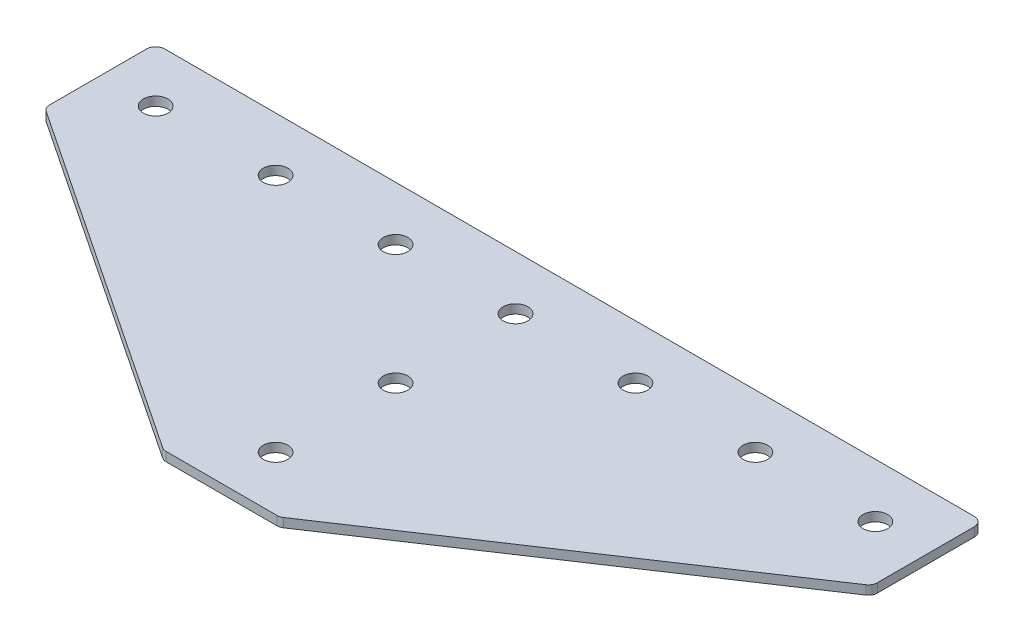
ISO-10303-21;
HEADER;
FILE_DESCRIPTION(('STEP AP214'),'2;1');
FILE_NAME('part.step','',(''),(''),'','','');
FILE_SCHEMA(('AUTOMOTIVE_DESIGN { 1 0 10303 214 1 1 1 1 }'));
ENDSEC;
DATA;
#1=APPLICATION_CONTEXT('core data for automotive mechanical design processes');
#2=APPLICATION_PROTOCOL_DEFINITION('international standard','automotive_design',2000,#1);
#3=PRODUCT_CONTEXT('',#1,'mechanical');
#4=PRODUCT('Part','Part','',(#3));
#5=PRODUCT_RELATED_PRODUCT_CATEGORY('part','',(#4));
#6=PRODUCT_DEFINITION_FORMATION('','',#4);
#7=PRODUCT_DEFINITION_CONTEXT('part definition',#1,'design');
#8=PRODUCT_DEFINITION('design','',#6,#7);
#9=PRODUCT_DEFINITION_SHAPE('','',#8);
#10=(LENGTH_UNIT() NAMED_UNIT(*) SI_UNIT(.MILLI.,.METRE.));
#11=(NAMED_UNIT(*) PLANE_ANGLE_UNIT() SI_UNIT($,.RADIAN.));
#12=(NAMED_UNIT(*) SI_UNIT($,.STERADIAN.) SOLID_ANGLE_UNIT());
#13=UNCERTAINTY_MEASURE_WITH_UNIT(LENGTH_MEASURE(1.E-05),#10,'distance_accuracy_value','');
#14=(GEOMETRIC_REPRESENTATION_CONTEXT(3) GLOBAL_UNCERTAINTY_ASSIGNED_CONTEXT((#13)) GLOBAL_UNIT_ASSIGNED_CONTEXT((#10,
#11,#12)) REPRESENTATION_CONTEXT('',''));
#15=CARTESIAN_POINT('',(0.,0.,0.));
#16=DIRECTION('',(0.,0.,1.));
#17=DIRECTION('',(1.,0.,0.));
#18=AXIS2_PLACEMENT_3D('',#15,#16,#17);
#19=CARTESIAN_POINT('',(-2.391536220955,1.20798729377475,-40.3160109846476));
#20=DIRECTION('',(0.,-1.,0.));
#21=DIRECTION('',(0.,0.,-1.));
#22=AXIS2_PLACEMENT_3D('',#19,#20,#21);
#23=PLANE('',#22);
#24=CARTESIAN_POINT('',(-2.391536220955,1.20798729377475,-40.3160109846476));
#25=DIRECTION('',(0.,1.,0.));
#26=DIRECTION('',(0.,0.,1.));
#27=AXIS2_PLACEMENT_3D('',#24,#25,#26);
#28=CIRCLE('',#27,4.1);
#29=CARTESIAN_POINT('',(-2.391536220955,1.20798729377475,-36.2160109846476));
#30=VERTEX_POINT('',#29);
#31=EDGE_CURVE('E119',#30,#30,#28,.T.);
#32=ORIENTED_EDGE('',*,*,#31,.T.);
#33=EDGE_LOOP('',(#32));
#34=FACE_BOUND('',#33,.T.);
#35=DIRECTION('',(1.,0.,0.));
#36=VECTOR('',#35,1.);
#37=CARTESIAN_POINT('',(-20.391536220955,1.20798729377475,57.6839890153524));
#38=LINE('',#37,#36);
#39=CARTESIAN_POINT('',(-20.877658032295,1.20798729377475,57.6839890153524));
#40=VERTEX_POINT('',#39);
#41=CARTESIAN_POINT('',(16.094585590385,1.20798729377475,57.6839890153524));
#42=VERTEX_POINT('',#41);
#43=EDGE_CURVE('E176',#40,#42,#38,.T.);
#44=ORIENTED_EDGE('',*,*,#43,.F.);
#45=CARTESIAN_POINT('',(-20.877658032295,1.20798729377475,54.6839890153524));
#46=DIRECTION('',(0.,1.,0.));
#47=DIRECTION('',(0.,0.,-1.));
#48=AXIS2_PLACEMENT_3D('',#45,#46,#47);
#49=CIRCLE('',#48,3.);
#50=CARTESIAN_POINT('',(-22.5417586209707,1.20798729377475,57.1801398983659));
#51=VERTEX_POINT('',#50);
#52=EDGE_CURVE('E233',#51,#40,#49,.T.);
#53=ORIENTED_EDGE('',*,*,#52,.F.);
#54=DIRECTION('',(-0.832050294337844,0.,-0.554700196225229));
#55=VECTOR('',#54,1.);
#56=CARTESIAN_POINT('',(-21.7859849454909,1.20798729377475,57.6839890153524));
#57=LINE('',#56,#55);
#58=CARTESIAN_POINT('',(-139.055636809631,1.20798729377475,-20.495778894074));
#59=VERTEX_POINT('',#58);
#60=EDGE_CURVE('E236',#51,#59,#57,.T.);
#61=ORIENTED_EDGE('',*,*,#60,.T.);
#62=CARTESIAN_POINT('',(-137.391536220955,1.20798729377475,-22.9919297770876));
#63=DIRECTION('',(0.,1.,0.));
#64=DIRECTION('',(0.,0.,-1.));
#65=AXIS2_PLACEMENT_3D('',#62,#63,#64);
#66=CIRCLE('',#65,3.);
#67=CARTESIAN_POINT('',(-140.391536220955,1.20798729377475,-22.9919297770875));
#68=VERTEX_POINT('',#67);
#69=EDGE_CURVE('E239',#68,#59,#66,.T.);
#70=ORIENTED_EDGE('',*,*,#69,.F.);
#71=DIRECTION('',(0.,0.,-1.));
#72=VECTOR('',#71,1.);
#73=CARTESIAN_POINT('',(-140.391536220955,1.20798729377475,-21.3863785016236));
#74=LINE('',#73,#72);
#75=CARTESIAN_POINT('',(-140.391536220955,1.20798729377475,-55.3160109846476));
#76=VERTEX_POINT('',#75);
#77=EDGE_CURVE('E130',#68,#76,#74,.T.);
#78=ORIENTED_EDGE('',*,*,#77,.T.);
#79=CARTESIAN_POINT('',(-137.391536220955,1.20798729377475,-55.3160109846476));
#80=DIRECTION('',(0.,1.,0.));
#81=DIRECTION('',(0.,0.,-1.));
#82=AXIS2_PLACEMENT_3D('',#79,#80,#81);
#83=CIRCLE('',#82,3.);
#84=CARTESIAN_POINT('',(-137.391536220955,1.20798729377475,-58.3160109846476));
#85=VERTEX_POINT('',#84);
#86=EDGE_CURVE('E245',#85,#76,#83,.T.);
#87=ORIENTED_EDGE('',*,*,#86,.F.);
#88=DIRECTION('',(-1.,0.,0.));
#89=VECTOR('',#88,1.);
#90=CARTESIAN_POINT('',(135.608463779045,1.20798729377475,-58.3160109846476));
#91=LINE('',#90,#89);
#92=CARTESIAN_POINT('',(132.608463779045,1.20798729377475,-58.3160109846476));
#93=VERTEX_POINT('',#92);
#94=EDGE_CURVE('E134',#93,#85,#91,.T.);
#95=ORIENTED_EDGE('',*,*,#94,.F.);
#96=CARTESIAN_POINT('',(132.608463779045,1.20798729377475,-55.3160109846476));
#97=DIRECTION('',(0.,-1.,0.));
#98=DIRECTION('',(0.,0.,-1.));
#99=AXIS2_PLACEMENT_3D('',#96,#97,#98);
#100=CIRCLE('',#99,3.);
#101=CARTESIAN_POINT('',(135.608463779045,1.20798729377475,-55.3160109846476));
#102=VERTEX_POINT('',#101);
#103=EDGE_CURVE('E197',#93,#102,#100,.T.);
#104=ORIENTED_EDGE('',*,*,#103,.T.);
#105=DIRECTION('',(0.,0.,-1.));
#106=VECTOR('',#105,1.);
#107=CARTESIAN_POINT('',(135.608463779045,1.20798729377475,-21.3863785016236));
#108=LINE('',#107,#106);
#109=CARTESIAN_POINT('',(135.608463779045,1.20798729377475,-22.9919297770876));
#110=VERTEX_POINT('',#109);
#111=EDGE_CURVE('E181',#110,#102,#108,.T.);
#112=ORIENTED_EDGE('',*,*,#111,.F.);
#113=CARTESIAN_POINT('',(132.608463779045,1.20798729377475,-22.9919297770876));
#114=DIRECTION('',(0.,-1.,0.));
#115=DIRECTION('',(0.,0.,-1.));
#116=AXIS2_PLACEMENT_3D('',#113,#114,#115);
#117=CIRCLE('',#116,3.);
#118=CARTESIAN_POINT('',(134.272564367721,1.20798729377475,-20.495778894074));
#119=VERTEX_POINT('',#118);
#120=EDGE_CURVE('E31',#110,#119,#117,.T.);
#121=ORIENTED_EDGE('',*,*,#120,.T.);
#122=DIRECTION('',(0.832050294337844,0.,-0.554700196225229));
#123=VECTOR('',#122,1.);
#124=CARTESIAN_POINT('',(17.002912503581,1.20798729377475,57.6839890153524));
#125=LINE('',#124,#123);
#126=CARTESIAN_POINT('',(17.7586861790607,1.20798729377475,57.1801398983659));
#127=VERTEX_POINT('',#126);
#128=EDGE_CURVE('E179',#127,#119,#125,.T.);
#129=ORIENTED_EDGE('',*,*,#128,.F.);
#130=CARTESIAN_POINT('',(16.094585590385,1.20798729377475,54.6839890153524));
#131=DIRECTION('',(0.,-1.,0.));
#132=DIRECTION('',(0.,0.,-1.));
#133=AXIS2_PLACEMENT_3D('',#130,#131,#132);
#134=CIRCLE('',#133,3.);
#135=EDGE_CURVE('E200',#127,#42,#134,.T.);
#136=ORIENTED_EDGE('',*,*,#135,.T.);
#137=EDGE_LOOP('',(#44,#53,#61,#70,#78,#87,#95,#104,#112,#121,#129,#136));
#138=FACE_BOUND('',#137,.T.);
#139=CARTESIAN_POINT('',(-2.39153622095501,1.20798729377475,39.6839890153524));
#140=DIRECTION('',(0.,1.,0.));
#141=DIRECTION('',(0.,0.,1.));
#142=AXIS2_PLACEMENT_3D('',#139,#140,#141);
#143=CIRCLE('',#142,4.1);
#144=CARTESIAN_POINT('',(-2.39153622095501,1.20798729377475,43.7839890153524));
#145=VERTEX_POINT('',#144);
#146=EDGE_CURVE('E153',#145,#145,#143,.T.);
#147=ORIENTED_EDGE('',*,*,#146,.T.);
#148=EDGE_LOOP('',(#147));
#149=FACE_BOUND('',#148,.T.);
#150=CARTESIAN_POINT('',(-2.39153622095501,1.20798729377475,-0.316010984647577));
#151=DIRECTION('',(0.,1.,0.));
#152=DIRECTION('',(0.,0.,1.));
#153=AXIS2_PLACEMENT_3D('',#150,#151,#152);
#154=CIRCLE('',#153,4.1);
#155=CARTESIAN_POINT('',(-2.39153622095501,1.20798729377475,3.78398901535242));
#156=VERTEX_POINT('',#155);
#157=EDGE_CURVE('E159',#156,#156,#154,.T.);
#158=ORIENTED_EDGE('',*,*,#157,.T.);
#159=EDGE_LOOP('',(#158));
#160=FACE_BOUND('',#159,.T.);
#161=CARTESIAN_POINT('',(117.608463779045,1.20798729377475,-40.3160109846476));
#162=DIRECTION('',(0.,1.,0.));
#163=DIRECTION('',(0.,0.,1.));
#164=AXIS2_PLACEMENT_3D('',#161,#162,#163);
#165=CIRCLE('',#164,4.09999999999999);
#166=CARTESIAN_POINT('',(117.608463779045,1.20798729377475,-36.2160109846476));
#167=VERTEX_POINT('',#166);
#168=EDGE_CURVE('E139',#167,#167,#165,.T.);
#169=ORIENTED_EDGE('',*,*,#168,.T.);
#170=EDGE_LOOP('',(#169));
#171=FACE_BOUND('',#170,.T.);
#172=CARTESIAN_POINT('',(77.608463779045,1.20798729377475,-40.3160109846476));
#173=DIRECTION('',(0.,1.,0.));
#174=DIRECTION('',(0.,0.,1.));
#175=AXIS2_PLACEMENT_3D('',#172,#173,#174);
#176=CIRCLE('',#175,4.1);
#177=CARTESIAN_POINT('',(77.608463779045,1.20798729377475,-36.2160109846476));
#178=VERTEX_POINT('',#177);
#179=EDGE_CURVE('E147',#178,#178,#176,.T.);
#180=ORIENTED_EDGE('',*,*,#179,.T.);
#181=EDGE_LOOP('',(#180));
#182=FACE_BOUND('',#181,.T.);
#183=CARTESIAN_POINT('',(37.608463779045,1.20798729377475,-40.3160109846476));
#184=DIRECTION('',(0.,1.,0.));
#185=DIRECTION('',(0.,0.,1.));
#186=AXIS2_PLACEMENT_3D('',#183,#184,#185);
#187=CIRCLE('',#186,4.1);
#188=CARTESIAN_POINT('',(37.608463779045,1.20798729377475,-36.2160109846476));
#189=VERTEX_POINT('',#188);
#190=EDGE_CURVE('E165',#189,#189,#187,.T.);
#191=ORIENTED_EDGE('',*,*,#190,.T.);
#192=EDGE_LOOP('',(#191));
#193=FACE_BOUND('',#192,.T.);
#194=CARTESIAN_POINT('',(-122.391536220955,1.20798729377475,-40.3160109846476));
#195=DIRECTION('',(0.,-1.,0.));
#196=DIRECTION('',(0.,0.,1.));
#197=AXIS2_PLACEMENT_3D('',#194,#195,#196);
#198=CIRCLE('',#197,4.09999999999999);
#199=CARTESIAN_POINT('',(-122.391536220955,1.20798729377475,-36.2160109846476));
#200=VERTEX_POINT('',#199);
#201=EDGE_CURVE('E465',#200,#200,#198,.T.);
#202=ORIENTED_EDGE('',*,*,#201,.F.);
#203=EDGE_LOOP('',(#202));
#204=FACE_BOUND('',#203,.T.);
#205=CARTESIAN_POINT('',(-82.391536220955,1.20798729377475,-40.3160109846476));
#206=DIRECTION('',(0.,-1.,0.));
#207=DIRECTION('',(0.,0.,1.));
#208=AXIS2_PLACEMENT_3D('',#205,#206,#207);
#209=CIRCLE('',#208,4.1);
#210=CARTESIAN_POINT('',(-82.391536220955,1.20798729377475,-36.2160109846476));
#211=VERTEX_POINT('',#210);
#212=EDGE_CURVE('E474',#211,#211,#209,.T.);
#213=ORIENTED_EDGE('',*,*,#212,.F.);
#214=EDGE_LOOP('',(#213));
#215=FACE_BOUND('',#214,.T.);
#216=CARTESIAN_POINT('',(-42.391536220955,1.20798729377475,-40.3160109846476));
#217=DIRECTION('',(0.,-1.,0.));
#218=DIRECTION('',(0.,0.,1.));
#219=AXIS2_PLACEMENT_3D('',#216,#217,#218);
#220=CIRCLE('',#219,4.1);
#221=CARTESIAN_POINT('',(-42.391536220955,1.20798729377475,-36.2160109846476));
#222=VERTEX_POINT('',#221);
#223=EDGE_CURVE('E266',#222,#222,#220,.T.);
#224=ORIENTED_EDGE('',*,*,#223,.F.);
#225=EDGE_LOOP('',(#224));
#226=FACE_BOUND('',#225,.T.);
#227=ADVANCED_FACE('F16',(#34,#138,#149,#160,#171,#182,#193,#204,#215,#226),#23,.T.);
#228=CARTESIAN_POINT('',(135.608463779045,1.20798729377475,-58.3160109846476));
#229=DIRECTION('',(0.,0.,-1.));
#230=DIRECTION('',(-1.,0.,0.));
#231=AXIS2_PLACEMENT_3D('',#228,#229,#230);
#232=PLANE('',#231);
#233=ORIENTED_EDGE('',*,*,#94,.T.);
#234=DIRECTION('',(0.,1.,0.));
#235=VECTOR('',#234,1.);
#236=CARTESIAN_POINT('',(-137.391536220955,1.20798729377475,-58.3160109846476));
#237=LINE('',#236,#235);
#238=CARTESIAN_POINT('',(-137.391536220955,4.20798729377475,-58.3160109846476));
#239=VERTEX_POINT('',#238);
#240=EDGE_CURVE('E125',#239,#85,#237,.F.);
#241=ORIENTED_EDGE('',*,*,#240,.F.);
#242=DIRECTION('',(-1.,0.,0.));
#243=VECTOR('',#242,1.);
#244=CARTESIAN_POINT('',(135.608463779045,4.20798729377475,-58.3160109846476));
#245=LINE('',#244,#243);
#246=CARTESIAN_POINT('',(132.608463779045,4.20798729377475,-58.3160109846476));
#247=VERTEX_POINT('',#246);
#248=EDGE_CURVE('E105',#247,#239,#245,.T.);
#249=ORIENTED_EDGE('',*,*,#248,.F.);
#250=DIRECTION('',(0.,1.,0.));
#251=VECTOR('',#250,1.);
#252=CARTESIAN_POINT('',(132.608463779045,1.20798729377475,-58.3160109846476));
#253=LINE('',#252,#251);
#254=EDGE_CURVE('E10',#247,#93,#253,.F.);
#255=ORIENTED_EDGE('',*,*,#254,.T.);
#256=EDGE_LOOP('',(#233,#241,#249,#255));
#257=FACE_BOUND('',#256,.T.);
#258=ADVANCED_FACE('F132',(#257),#232,.T.);
#259=CARTESIAN_POINT('',(135.608463779045,1.20798729377475,-21.3863785016236));
#260=DIRECTION('',(1.,0.,0.));
#261=DIRECTION('',(0.,0.,-1.));
#262=AXIS2_PLACEMENT_3D('',#259,#260,#261);
#263=PLANE('',#262);
#264=DIRECTION('',(0.,0.,-1.));
#265=VECTOR('',#264,1.);
#266=CARTESIAN_POINT('',(135.608463779045,4.20798729377475,-21.3863785016236));
#267=LINE('',#266,#265);
#268=CARTESIAN_POINT('',(135.608463779045,4.20798729377475,-22.9919297770876));
#269=VERTEX_POINT('',#268);
#270=CARTESIAN_POINT('',(135.608463779045,4.20798729377475,-55.3160109846476));
#271=VERTEX_POINT('',#270);
#272=EDGE_CURVE('E177',#269,#271,#267,.T.);
#273=ORIENTED_EDGE('',*,*,#272,.F.);
#274=DIRECTION('',(0.,1.,0.));
#275=VECTOR('',#274,1.);
#276=CARTESIAN_POINT('',(135.608463779045,1.20798729377475,-22.9919297770876));
#277=LINE('',#276,#275);
#278=EDGE_CURVE('E24',#269,#110,#277,.F.);
#279=ORIENTED_EDGE('',*,*,#278,.T.);
#280=ORIENTED_EDGE('',*,*,#111,.T.);
#281=DIRECTION('',(0.,1.,0.));
#282=VECTOR('',#281,1.);
#283=CARTESIAN_POINT('',(135.608463779045,1.20798729377475,-55.3160109846476));
#284=LINE('',#283,#282);
#285=EDGE_CURVE('E207',#102,#271,#284,.T.);
#286=ORIENTED_EDGE('',*,*,#285,.T.);
#287=EDGE_LOOP('',(#273,#279,#280,#286));
#288=FACE_BOUND('',#287,.T.);
#289=ADVANCED_FACE('F212',(#288),#263,.T.);
#290=CARTESIAN_POINT('',(17.002912503581,1.20798729377475,57.6839890153524));
#291=DIRECTION('',(0.554700196225229,0.,0.832050294337844));
#292=DIRECTION('',(0.832050294337844,0.,-0.554700196225229));
#293=AXIS2_PLACEMENT_3D('',#290,#291,#292);
#294=PLANE('',#293);
#295=DIRECTION('',(0.832050294337844,0.,-0.554700196225229));
#296=VECTOR('',#295,1.);
#297=CARTESIAN_POINT('',(17.002912503581,4.20798729377475,57.6839890153524));
#298=LINE('',#297,#296);
#299=CARTESIAN_POINT('',(17.7586861790607,4.20798729377475,57.1801398983659));
#300=VERTEX_POINT('',#299);
#301=CARTESIAN_POINT('',(134.272564367721,4.20798729377475,-20.495778894074));
#302=VERTEX_POINT('',#301);
#303=EDGE_CURVE('E185',#300,#302,#298,.T.);
#304=ORIENTED_EDGE('',*,*,#303,.F.);
#305=DIRECTION('',(0.,1.,0.));
#306=VECTOR('',#305,1.);
#307=CARTESIAN_POINT('',(17.7586861790607,1.20798729377475,57.1801398983659));
#308=LINE('',#307,#306);
#309=EDGE_CURVE('E38',#300,#127,#308,.F.);
#310=ORIENTED_EDGE('',*,*,#309,.T.);
#311=ORIENTED_EDGE('',*,*,#128,.T.);
#312=DIRECTION('',(0.,1.,0.));
#313=VECTOR('',#312,1.);
#314=CARTESIAN_POINT('',(134.272564367721,1.20798729377475,-20.4957788940741));
#315=LINE('',#314,#313);
#316=EDGE_CURVE('E203',#119,#302,#315,.T.);
#317=ORIENTED_EDGE('',*,*,#316,.T.);
#318=EDGE_LOOP('',(#304,#310,#311,#317));
#319=FACE_BOUND('',#318,.T.);
#320=ADVANCED_FACE('F219',(#319),#294,.T.);
#321=CARTESIAN_POINT('',(-20.391536220955,1.20798729377475,57.6839890153524));
#322=DIRECTION('',(0.,0.,1.));
#323=DIRECTION('',(1.,0.,0.));
#324=AXIS2_PLACEMENT_3D('',#321,#322,#323);
#325=PLANE('',#324);
#326=DIRECTION('',(1.,0.,0.));
#327=VECTOR('',#326,1.);
#328=CARTESIAN_POINT('',(-20.391536220955,4.20798729377475,57.6839890153524));
#329=LINE('',#328,#327);
#330=CARTESIAN_POINT('',(-20.877658032295,4.20798729377475,57.6839890153524));
#331=VERTEX_POINT('',#330);
#332=CARTESIAN_POINT('',(16.094585590385,4.20798729377475,57.6839890153524));
#333=VERTEX_POINT('',#332);
#334=EDGE_CURVE('E118',#331,#333,#329,.T.);
#335=ORIENTED_EDGE('',*,*,#334,.F.);
#336=DIRECTION('',(0.,1.,0.));
#337=VECTOR('',#336,1.);
#338=CARTESIAN_POINT('',(-20.877658032295,1.20798729377475,57.6839890153524));
#339=LINE('',#338,#337);
#340=EDGE_CURVE('E229',#40,#331,#339,.T.);
#341=ORIENTED_EDGE('',*,*,#340,.F.);
#342=ORIENTED_EDGE('',*,*,#43,.T.);
#343=DIRECTION('',(0.,1.,0.));
#344=VECTOR('',#343,1.);
#345=CARTESIAN_POINT('',(16.094585590385,1.20798729377475,57.6839890153524));
#346=LINE('',#345,#344);
#347=EDGE_CURVE('E194',#42,#333,#346,.T.);
#348=ORIENTED_EDGE('',*,*,#347,.T.);
#349=EDGE_LOOP('',(#335,#341,#342,#348));
#350=FACE_BOUND('',#349,.T.);
#351=ADVANCED_FACE('F226',(#350),#325,.T.);
#352=CARTESIAN_POINT('',(-2.391536220955,4.20798729377475,-40.3160109846476));
#353=DIRECTION('',(0.,-1.,0.));
#354=DIRECTION('',(0.,0.,-1.));
#355=AXIS2_PLACEMENT_3D('',#352,#353,#354);
#356=PLANE('',#355);
#357=CARTESIAN_POINT('',(-2.391536220955,4.20798729377475,-40.3160109846476));
#358=DIRECTION('',(0.,1.,0.));
#359=DIRECTION('',(0.,0.,1.));
#360=AXIS2_PLACEMENT_3D('',#357,#358,#359);
#361=CIRCLE('',#360,4.1);
#362=CARTESIAN_POINT('',(-2.391536220955,4.20798729377475,-36.2160109846476));
#363=VERTEX_POINT('',#362);
#364=EDGE_CURVE('E168',#363,#363,#361,.T.);
#365=ORIENTED_EDGE('',*,*,#364,.F.);
#366=EDGE_LOOP('',(#365));
#367=FACE_BOUND('',#366,.T.);
#368=CARTESIAN_POINT('',(-20.877658032295,4.20798729377475,54.6839890153524));
#369=DIRECTION('',(0.,1.,0.));
#370=DIRECTION('',(0.,0.,-1.));
#371=AXIS2_PLACEMENT_3D('',#368,#369,#370);
#372=CIRCLE('',#371,3.);
#373=CARTESIAN_POINT('',(-22.5417586209707,4.20798729377475,57.1801398983659));
#374=VERTEX_POINT('',#373);
#375=EDGE_CURVE('E251',#331,#374,#372,.F.);
#376=ORIENTED_EDGE('',*,*,#375,.F.);
#377=ORIENTED_EDGE('',*,*,#334,.T.);
#378=CARTESIAN_POINT('',(16.094585590385,4.20798729377475,54.6839890153524));
#379=DIRECTION('',(0.,-1.,0.));
#380=DIRECTION('',(0.,0.,-1.));
#381=AXIS2_PLACEMENT_3D('',#378,#379,#380);
#382=CIRCLE('',#381,3.);
#383=EDGE_CURVE('E192',#333,#300,#382,.F.);
#384=ORIENTED_EDGE('',*,*,#383,.T.);
#385=ORIENTED_EDGE('',*,*,#303,.T.);
#386=CARTESIAN_POINT('',(132.608463779045,4.20798729377475,-22.9919297770876));
#387=DIRECTION('',(0.,-1.,0.));
#388=DIRECTION('',(0.,0.,-1.));
#389=AXIS2_PLACEMENT_3D('',#386,#387,#388);
#390=CIRCLE('',#389,3.);
#391=EDGE_CURVE('E190',#302,#269,#390,.F.);
#392=ORIENTED_EDGE('',*,*,#391,.T.);
#393=ORIENTED_EDGE('',*,*,#272,.T.);
#394=CARTESIAN_POINT('',(132.608463779045,4.20798729377475,-55.3160109846476));
#395=DIRECTION('',(0.,-1.,0.));
#396=DIRECTION('',(0.,0.,-1.));
#397=AXIS2_PLACEMENT_3D('',#394,#395,#396);
#398=CIRCLE('',#397,3.);
#399=EDGE_CURVE('E114',#271,#247,#398,.F.);
#400=ORIENTED_EDGE('',*,*,#399,.T.);
#401=ORIENTED_EDGE('',*,*,#248,.T.);
#402=CARTESIAN_POINT('',(-137.391536220955,4.20798729377475,-55.3160109846476));
#403=DIRECTION('',(0.,1.,0.));
#404=DIRECTION('',(0.,0.,-1.));
#405=AXIS2_PLACEMENT_3D('',#402,#403,#404);
#406=CIRCLE('',#405,3.);
#407=CARTESIAN_POINT('',(-140.391536220955,4.20798729377475,-55.3160109846476));
#408=VERTEX_POINT('',#407);
#409=EDGE_CURVE('E111',#408,#239,#406,.F.);
#410=ORIENTED_EDGE('',*,*,#409,.F.);
#411=DIRECTION('',(0.,0.,-1.));
#412=VECTOR('',#411,1.);
#413=CARTESIAN_POINT('',(-140.391536220955,4.20798729377475,-21.3863785016236));
#414=LINE('',#413,#412);
#415=CARTESIAN_POINT('',(-140.391536220955,4.20798729377475,-22.9919297770875));
#416=VERTEX_POINT('',#415);
#417=EDGE_CURVE('E256',#416,#408,#414,.T.);
#418=ORIENTED_EDGE('',*,*,#417,.F.);
#419=CARTESIAN_POINT('',(-137.391536220955,4.20798729377475,-22.9919297770876));
#420=DIRECTION('',(0.,1.,0.));
#421=DIRECTION('',(0.,0.,-1.));
#422=AXIS2_PLACEMENT_3D('',#419,#420,#421);
#423=CIRCLE('',#422,3.);
#424=CARTESIAN_POINT('',(-139.055636809631,4.20798729377475,-20.495778894074));
#425=VERTEX_POINT('',#424);
#426=EDGE_CURVE('E129',#425,#416,#423,.F.);
#427=ORIENTED_EDGE('',*,*,#426,.F.);
#428=DIRECTION('',(-0.832050294337844,0.,-0.554700196225229));
#429=VECTOR('',#428,1.);
#430=CARTESIAN_POINT('',(-21.7859849454909,4.20798729377475,57.6839890153524));
#431=LINE('',#430,#429);
#432=EDGE_CURVE('E260',#374,#425,#431,.T.);
#433=ORIENTED_EDGE('',*,*,#432,.F.);
#434=EDGE_LOOP('',(#376,#377,#384,#385,#392,#393,#400,#401,#410,#418,#427,#433));
#435=FACE_BOUND('',#434,.T.);
#436=CARTESIAN_POINT('',(-2.39153622095501,4.20798729377475,39.6839890153524));
#437=DIRECTION('',(0.,1.,0.));
#438=DIRECTION('',(0.,0.,1.));
#439=AXIS2_PLACEMENT_3D('',#436,#437,#438);
#440=CIRCLE('',#439,4.1);
#441=CARTESIAN_POINT('',(-2.39153622095501,4.20798729377475,43.7839890153524));
#442=VERTEX_POINT('',#441);
#443=EDGE_CURVE('E150',#442,#442,#440,.T.);
#444=ORIENTED_EDGE('',*,*,#443,.F.);
#445=EDGE_LOOP('',(#444));
#446=FACE_BOUND('',#445,.T.);
#447=CARTESIAN_POINT('',(117.608463779045,4.20798729377475,-40.3160109846476));
#448=DIRECTION('',(0.,1.,0.));
#449=DIRECTION('',(0.,0.,1.));
#450=AXIS2_PLACEMENT_3D('',#447,#448,#449);
#451=CIRCLE('',#450,4.09999999999999);
#452=CARTESIAN_POINT('',(117.608463779045,4.20798729377475,-36.2160109846476));
#453=VERTEX_POINT('',#452);
#454=EDGE_CURVE('E135',#453,#453,#451,.T.);
#455=ORIENTED_EDGE('',*,*,#454,.F.);
#456=EDGE_LOOP('',(#455));
#457=FACE_BOUND('',#456,.T.);
#458=CARTESIAN_POINT('',(77.608463779045,4.20798729377475,-40.3160109846476));
#459=DIRECTION('',(0.,1.,0.));
#460=DIRECTION('',(0.,0.,1.));
#461=AXIS2_PLACEMENT_3D('',#458,#459,#460);
#462=CIRCLE('',#461,4.1);
#463=CARTESIAN_POINT('',(77.608463779045,4.20798729377475,-36.2160109846476));
#464=VERTEX_POINT('',#463);
#465=EDGE_CURVE('E145',#464,#464,#462,.T.);
#466=ORIENTED_EDGE('',*,*,#465,.F.);
#467=EDGE_LOOP('',(#466));
#468=FACE_BOUND('',#467,.T.);
#469=CARTESIAN_POINT('',(37.608463779045,4.20798729377475,-40.3160109846476));
#470=DIRECTION('',(0.,1.,0.));
#471=DIRECTION('',(0.,0.,1.));
#472=AXIS2_PLACEMENT_3D('',#469,#470,#471);
#473=CIRCLE('',#472,4.1);
#474=CARTESIAN_POINT('',(37.608463779045,4.20798729377475,-36.2160109846476));
#475=VERTEX_POINT('',#474);
#476=EDGE_CURVE('E162',#475,#475,#473,.T.);
#477=ORIENTED_EDGE('',*,*,#476,.F.);
#478=EDGE_LOOP('',(#477));
#479=FACE_BOUND('',#478,.T.);
#480=CARTESIAN_POINT('',(-2.39153622095501,4.20798729377475,-0.316010984647577));
#481=DIRECTION('',(0.,1.,0.));
#482=DIRECTION('',(0.,0.,1.));
#483=AXIS2_PLACEMENT_3D('',#480,#481,#482);
#484=CIRCLE('',#483,4.1);
#485=CARTESIAN_POINT('',(-2.39153622095501,4.20798729377475,3.78398901535242));
#486=VERTEX_POINT('',#485);
#487=EDGE_CURVE('E156',#486,#486,#484,.T.);
#488=ORIENTED_EDGE('',*,*,#487,.F.);
#489=EDGE_LOOP('',(#488));
#490=FACE_BOUND('',#489,.T.);
#491=CARTESIAN_POINT('',(-122.391536220955,4.20798729377475,-40.3160109846476));
#492=DIRECTION('',(0.,-1.,0.));
#493=DIRECTION('',(0.,0.,1.));
#494=AXIS2_PLACEMENT_3D('',#491,#492,#493);
#495=CIRCLE('',#494,4.09999999999999);
#496=CARTESIAN_POINT('',(-122.391536220955,4.20798729377475,-36.2160109846476));
#497=VERTEX_POINT('',#496);
#498=EDGE_CURVE('E468',#497,#497,#495,.T.);
#499=ORIENTED_EDGE('',*,*,#498,.T.);
#500=EDGE_LOOP('',(#499));
#501=FACE_BOUND('',#500,.T.);
#502=CARTESIAN_POINT('',(-82.391536220955,4.20798729377475,-40.3160109846476));
#503=DIRECTION('',(0.,-1.,0.));
#504=DIRECTION('',(0.,0.,1.));
#505=AXIS2_PLACEMENT_3D('',#502,#503,#504);
#506=CIRCLE('',#505,4.1);
#507=CARTESIAN_POINT('',(-82.391536220955,4.20798729377475,-36.2160109846476));
#508=VERTEX_POINT('',#507);
#509=EDGE_CURVE('E471',#508,#508,#506,.T.);
#510=ORIENTED_EDGE('',*,*,#509,.T.);
#511=EDGE_LOOP('',(#510));
#512=FACE_BOUND('',#511,.T.);
#513=CARTESIAN_POINT('',(-42.391536220955,4.20798729377475,-40.3160109846476));
#514=DIRECTION('',(0.,-1.,0.));
#515=DIRECTION('',(0.,0.,1.));
#516=AXIS2_PLACEMENT_3D('',#513,#514,#515);
#517=CIRCLE('',#516,4.1);
#518=CARTESIAN_POINT('',(-42.391536220955,4.20798729377475,-36.2160109846476));
#519=VERTEX_POINT('',#518);
#520=EDGE_CURVE('E263',#519,#519,#517,.T.);
#521=ORIENTED_EDGE('',*,*,#520,.T.);
#522=EDGE_LOOP('',(#521));
#523=FACE_BOUND('',#522,.T.);
#524=ADVANCED_FACE('F108',(#367,#435,#446,#457,#468,#479,#490,#501,#512,#523),#356,.F.);
#525=CARTESIAN_POINT('',(16.094585590385,1.20798729377475,54.6839890153524));
#526=DIRECTION('',(0.,1.,0.));
#527=DIRECTION('',(0.,0.,1.));
#528=AXIS2_PLACEMENT_3D('',#525,#526,#527);
#529=CYLINDRICAL_SURFACE('',#528,3.);
#530=ORIENTED_EDGE('',*,*,#135,.F.);
#531=ORIENTED_EDGE('',*,*,#309,.F.);
#532=ORIENTED_EDGE('',*,*,#383,.F.);
#533=ORIENTED_EDGE('',*,*,#347,.F.);
#534=EDGE_LOOP('',(#530,#531,#532,#533));
#535=FACE_BOUND('',#534,.T.);
#536=ADVANCED_FACE('F224',(#535),#529,.T.);
#537=CARTESIAN_POINT('',(132.608463779045,1.20798729377475,-22.9919297770876));
#538=DIRECTION('',(0.,1.,0.));
#539=DIRECTION('',(0.,0.,1.));
#540=AXIS2_PLACEMENT_3D('',#537,#538,#539);
#541=CYLINDRICAL_SURFACE('',#540,3.);
#542=ORIENTED_EDGE('',*,*,#120,.F.);
#543=ORIENTED_EDGE('',*,*,#278,.F.);
#544=ORIENTED_EDGE('',*,*,#391,.F.);
#545=ORIENTED_EDGE('',*,*,#316,.F.);
#546=EDGE_LOOP('',(#542,#543,#544,#545));
#547=FACE_BOUND('',#546,.T.);
#548=ADVANCED_FACE('F218',(#547),#541,.T.);
#549=CARTESIAN_POINT('',(132.608463779045,1.20798729377475,-55.3160109846476));
#550=DIRECTION('',(0.,1.,0.));
#551=DIRECTION('',(0.,0.,1.));
#552=AXIS2_PLACEMENT_3D('',#549,#550,#551);
#553=CYLINDRICAL_SURFACE('',#552,3.);
#554=ORIENTED_EDGE('',*,*,#103,.F.);
#555=ORIENTED_EDGE('',*,*,#254,.F.);
#556=ORIENTED_EDGE('',*,*,#399,.F.);
#557=ORIENTED_EDGE('',*,*,#285,.F.);
#558=EDGE_LOOP('',(#554,#555,#556,#557));
#559=FACE_BOUND('',#558,.T.);
#560=ADVANCED_FACE('F18',(#559),#553,.T.);
#561=CARTESIAN_POINT('',(-2.391536220955,1.20798729377475,-40.3160109846476));
#562=DIRECTION('',(0.,1.,0.));
#563=DIRECTION('',(0.,0.,1.));
#564=AXIS2_PLACEMENT_3D('',#561,#562,#563);
#565=CYLINDRICAL_SURFACE('',#564,4.1);
#566=ORIENTED_EDGE('',*,*,#31,.F.);
#567=EDGE_LOOP('',(#566));
#568=FACE_BOUND('',#567,.T.);
#569=ORIENTED_EDGE('',*,*,#364,.T.);
#570=EDGE_LOOP('',(#569));
#571=FACE_BOUND('',#570,.T.);
#572=ADVANCED_FACE('F300',(#568,#571),#565,.F.);
#573=CARTESIAN_POINT('',(37.608463779045,1.20798729377475,-40.3160109846476));
#574=DIRECTION('',(0.,1.,0.));
#575=DIRECTION('',(0.,0.,1.));
#576=AXIS2_PLACEMENT_3D('',#573,#574,#575);
#577=CYLINDRICAL_SURFACE('',#576,4.1);
#578=ORIENTED_EDGE('',*,*,#190,.F.);
#579=EDGE_LOOP('',(#578));
#580=FACE_BOUND('',#579,.T.);
#581=ORIENTED_EDGE('',*,*,#476,.T.);
#582=EDGE_LOOP('',(#581));
#583=FACE_BOUND('',#582,.T.);
#584=ADVANCED_FACE('F305',(#580,#583),#577,.F.);
#585=CARTESIAN_POINT('',(-2.39153622095501,1.20798729377475,-0.316010984647577));
#586=DIRECTION('',(0.,1.,0.));
#587=DIRECTION('',(0.,0.,1.));
#588=AXIS2_PLACEMENT_3D('',#585,#586,#587);
#589=CYLINDRICAL_SURFACE('',#588,4.1);
#590=ORIENTED_EDGE('',*,*,#487,.T.);
#591=EDGE_LOOP('',(#590));
#592=FACE_BOUND('',#591,.T.);
#593=ORIENTED_EDGE('',*,*,#157,.F.);
#594=EDGE_LOOP('',(#593));
#595=FACE_BOUND('',#594,.T.);
#596=ADVANCED_FACE('F311',(#592,#595),#589,.F.);
#597=CARTESIAN_POINT('',(-2.39153622095501,1.20798729377475,39.6839890153524));
#598=DIRECTION('',(0.,1.,0.));
#599=DIRECTION('',(0.,0.,1.));
#600=AXIS2_PLACEMENT_3D('',#597,#598,#599);
#601=CYLINDRICAL_SURFACE('',#600,4.1);
#602=ORIENTED_EDGE('',*,*,#443,.T.);
#603=EDGE_LOOP('',(#602));
#604=FACE_BOUND('',#603,.T.);
#605=ORIENTED_EDGE('',*,*,#146,.F.);
#606=EDGE_LOOP('',(#605));
#607=FACE_BOUND('',#606,.T.);
#608=ADVANCED_FACE('F366',(#604,#607),#601,.F.);
#609=CARTESIAN_POINT('',(77.608463779045,1.20798729377475,-40.3160109846476));
#610=DIRECTION('',(0.,1.,0.));
#611=DIRECTION('',(0.,0.,1.));
#612=AXIS2_PLACEMENT_3D('',#609,#610,#611);
#613=CYLINDRICAL_SURFACE('',#612,4.1);
#614=ORIENTED_EDGE('',*,*,#179,.F.);
#615=EDGE_LOOP('',(#614));
#616=FACE_BOUND('',#615,.T.);
#617=ORIENTED_EDGE('',*,*,#465,.T.);
#618=EDGE_LOOP('',(#617));
#619=FACE_BOUND('',#618,.T.);
#620=ADVANCED_FACE('F375',(#616,#619),#613,.F.);
#621=CARTESIAN_POINT('',(117.608463779045,1.20798729377475,-40.3160109846476));
#622=DIRECTION('',(0.,1.,0.));
#623=DIRECTION('',(0.,0.,1.));
#624=AXIS2_PLACEMENT_3D('',#621,#622,#623);
#625=CYLINDRICAL_SURFACE('',#624,4.09999999999999);
#626=ORIENTED_EDGE('',*,*,#168,.F.);
#627=EDGE_LOOP('',(#626));
#628=FACE_BOUND('',#627,.T.);
#629=ORIENTED_EDGE('',*,*,#454,.T.);
#630=EDGE_LOOP('',(#629));
#631=FACE_BOUND('',#630,.T.);
#632=ADVANCED_FACE('F385',(#628,#631),#625,.F.);
#633=CARTESIAN_POINT('',(-140.391536220955,1.20798729377475,-21.3863785016236));
#634=DIRECTION('',(-1.,0.,0.));
#635=DIRECTION('',(0.,0.,-1.));
#636=AXIS2_PLACEMENT_3D('',#633,#634,#635);
#637=PLANE('',#636);
#638=ORIENTED_EDGE('',*,*,#417,.T.);
#639=DIRECTION('',(0.,1.,0.));
#640=VECTOR('',#639,1.);
#641=CARTESIAN_POINT('',(-140.391536220955,1.20798729377475,-55.3160109846476));
#642=LINE('',#641,#640);
#643=EDGE_CURVE('E127',#76,#408,#642,.T.);
#644=ORIENTED_EDGE('',*,*,#643,.F.);
#645=ORIENTED_EDGE('',*,*,#77,.F.);
#646=DIRECTION('',(0.,1.,0.));
#647=VECTOR('',#646,1.);
#648=CARTESIAN_POINT('',(-140.391536220955,1.20798729377475,-22.9919297770875));
#649=LINE('',#648,#647);
#650=EDGE_CURVE('E136',#416,#68,#649,.F.);
#651=ORIENTED_EDGE('',*,*,#650,.F.);
#652=EDGE_LOOP('',(#638,#644,#645,#651));
#653=FACE_BOUND('',#652,.T.);
#654=ADVANCED_FACE('F273',(#653),#637,.T.);
#655=CARTESIAN_POINT('',(-21.7859849454909,1.20798729377475,57.6839890153524));
#656=DIRECTION('',(-0.554700196225229,0.,0.832050294337844));
#657=DIRECTION('',(-0.832050294337844,0.,-0.554700196225229));
#658=AXIS2_PLACEMENT_3D('',#655,#656,#657);
#659=PLANE('',#658);
#660=ORIENTED_EDGE('',*,*,#432,.T.);
#661=DIRECTION('',(0.,1.,0.));
#662=VECTOR('',#661,1.);
#663=CARTESIAN_POINT('',(-139.055636809631,1.20798729377475,-20.495778894074));
#664=LINE('',#663,#662);
#665=EDGE_CURVE('E238',#59,#425,#664,.T.);
#666=ORIENTED_EDGE('',*,*,#665,.F.);
#667=ORIENTED_EDGE('',*,*,#60,.F.);
#668=DIRECTION('',(0.,1.,0.));
#669=VECTOR('',#668,1.);
#670=CARTESIAN_POINT('',(-22.5417586209707,1.20798729377475,57.1801398983659));
#671=LINE('',#670,#669);
#672=EDGE_CURVE('E242',#374,#51,#671,.F.);
#673=ORIENTED_EDGE('',*,*,#672,.F.);
#674=EDGE_LOOP('',(#660,#666,#667,#673));
#675=FACE_BOUND('',#674,.T.);
#676=ADVANCED_FACE('F255',(#675),#659,.T.);
#677=CARTESIAN_POINT('',(-20.877658032295,1.20798729377475,54.6839890153524));
#678=DIRECTION('',(0.,1.,0.));
#679=DIRECTION('',(0.,0.,1.));
#680=AXIS2_PLACEMENT_3D('',#677,#678,#679);
#681=CYLINDRICAL_SURFACE('',#680,3.);
#682=ORIENTED_EDGE('',*,*,#52,.T.);
#683=ORIENTED_EDGE('',*,*,#340,.T.);
#684=ORIENTED_EDGE('',*,*,#375,.T.);
#685=ORIENTED_EDGE('',*,*,#672,.T.);
#686=EDGE_LOOP('',(#682,#683,#684,#685));
#687=FACE_BOUND('',#686,.T.);
#688=ADVANCED_FACE('F250',(#687),#681,.T.);
#689=CARTESIAN_POINT('',(-137.391536220955,1.20798729377475,-22.9919297770876));
#690=DIRECTION('',(0.,1.,0.));
#691=DIRECTION('',(0.,0.,1.));
#692=AXIS2_PLACEMENT_3D('',#689,#690,#691);
#693=CYLINDRICAL_SURFACE('',#692,3.);
#694=ORIENTED_EDGE('',*,*,#69,.T.);
#695=ORIENTED_EDGE('',*,*,#665,.T.);
#696=ORIENTED_EDGE('',*,*,#426,.T.);
#697=ORIENTED_EDGE('',*,*,#650,.T.);
#698=EDGE_LOOP('',(#694,#695,#696,#697));
#699=FACE_BOUND('',#698,.T.);
#700=ADVANCED_FACE('F275',(#699),#693,.T.);
#701=CARTESIAN_POINT('',(-137.391536220955,1.20798729377475,-55.3160109846476));
#702=DIRECTION('',(0.,1.,0.));
#703=DIRECTION('',(0.,0.,1.));
#704=AXIS2_PLACEMENT_3D('',#701,#702,#703);
#705=CYLINDRICAL_SURFACE('',#704,3.);
#706=ORIENTED_EDGE('',*,*,#86,.T.);
#707=ORIENTED_EDGE('',*,*,#643,.T.);
#708=ORIENTED_EDGE('',*,*,#409,.T.);
#709=ORIENTED_EDGE('',*,*,#240,.T.);
#710=EDGE_LOOP('',(#706,#707,#708,#709));
#711=FACE_BOUND('',#710,.T.);
#712=ADVANCED_FACE('F124',(#711),#705,.T.);
#713=CARTESIAN_POINT('',(-42.391536220955,1.20798729377475,-40.3160109846476));
#714=DIRECTION('',(0.,1.,0.));
#715=DIRECTION('',(0.,0.,1.));
#716=AXIS2_PLACEMENT_3D('',#713,#714,#715);
#717=CYLINDRICAL_SURFACE('',#716,4.1);
#718=ORIENTED_EDGE('',*,*,#223,.T.);
#719=EDGE_LOOP('',(#718));
#720=FACE_BOUND('',#719,.T.);
#721=ORIENTED_EDGE('',*,*,#520,.F.);
#722=EDGE_LOOP('',(#721));
#723=FACE_BOUND('',#722,.T.);
#724=ADVANCED_FACE('F283',(#720,#723),#717,.F.);
#725=CARTESIAN_POINT('',(-82.391536220955,1.20798729377475,-40.3160109846476));
#726=DIRECTION('',(0.,1.,0.));
#727=DIRECTION('',(0.,0.,1.));
#728=AXIS2_PLACEMENT_3D('',#725,#726,#727);
#729=CYLINDRICAL_SURFACE('',#728,4.1);
#730=ORIENTED_EDGE('',*,*,#212,.T.);
#731=EDGE_LOOP('',(#730));
#732=FACE_BOUND('',#731,.T.);
#733=ORIENTED_EDGE('',*,*,#509,.F.);
#734=EDGE_LOOP('',(#733));
#735=FACE_BOUND('',#734,.T.);
#736=ADVANCED_FACE('F436',(#732,#735),#729,.F.);
#737=CARTESIAN_POINT('',(-122.391536220955,1.20798729377475,-40.3160109846476));
#738=DIRECTION('',(0.,1.,0.));
#739=DIRECTION('',(0.,0.,1.));
#740=AXIS2_PLACEMENT_3D('',#737,#738,#739);
#741=CYLINDRICAL_SURFACE('',#740,4.09999999999999);
#742=ORIENTED_EDGE('',*,*,#201,.T.);
#743=EDGE_LOOP('',(#742));
#744=FACE_BOUND('',#743,.T.);
#745=ORIENTED_EDGE('',*,*,#498,.F.);
#746=EDGE_LOOP('',(#745));
#747=FACE_BOUND('',#746,.T.);
#748=ADVANCED_FACE('F446',(#744,#747),#741,.F.);
#749=CLOSED_SHELL('',(#227,#258,#289,#320,#351,#524,#536,#548,#560,#572,#584,#596,#608,#620,
#632,#654,#676,#688,#700,#712,#724,#736,#748));
#750=MANIFOLD_SOLID_BREP('B1',#749);
#751=ADVANCED_BREP_SHAPE_REPRESENTATION('',(#18,#750),#14);
#752=SHAPE_DEFINITION_REPRESENTATION(#9,#751);
ENDSEC;
END-ISO-10303-21;
